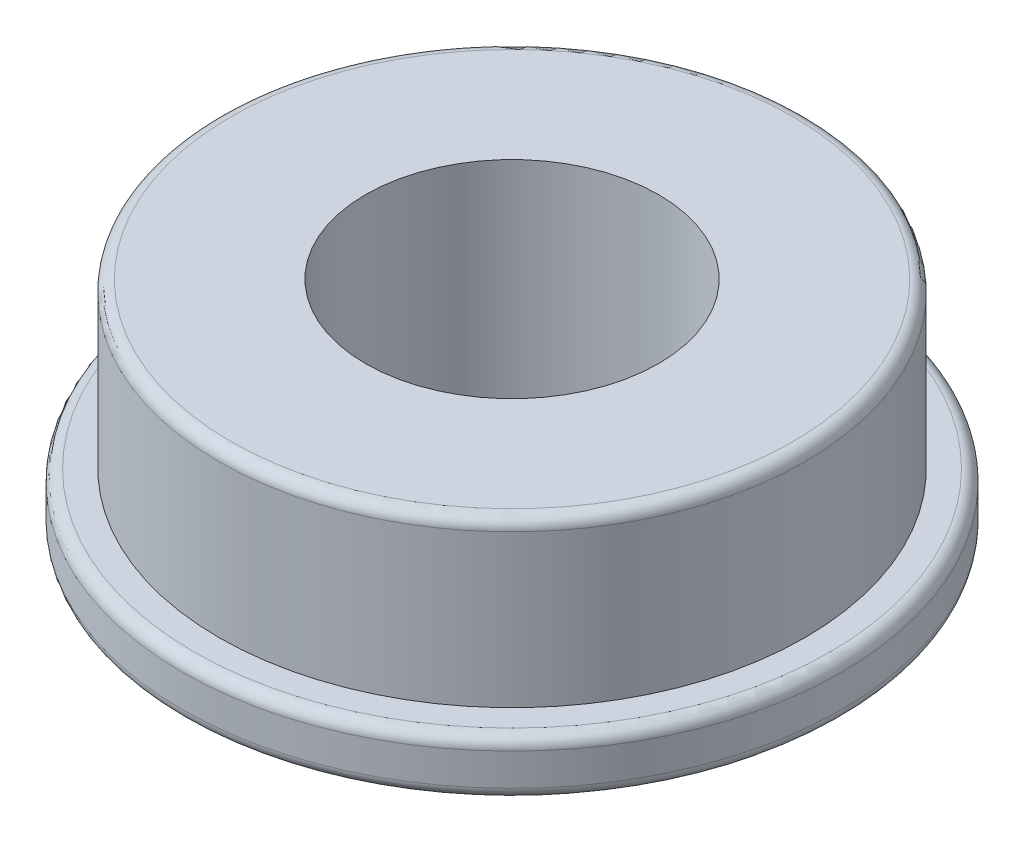
ISO-10303-21;
HEADER;
FILE_DESCRIPTION(('STEP AP214'),'2;1');
FILE_NAME('part.step','',(''),(''),'','','');
FILE_SCHEMA(('AUTOMOTIVE_DESIGN { 1 0 10303 214 1 1 1 1 }'));
ENDSEC;
DATA;
#1=APPLICATION_CONTEXT('core data for automotive mechanical design processes');
#2=APPLICATION_PROTOCOL_DEFINITION('international standard','automotive_design',2000,#1);
#3=PRODUCT_CONTEXT('',#1,'mechanical');
#4=PRODUCT('Part','Part','',(#3));
#5=PRODUCT_RELATED_PRODUCT_CATEGORY('part','',(#4));
#6=PRODUCT_DEFINITION_FORMATION('','',#4);
#7=PRODUCT_DEFINITION_CONTEXT('part definition',#1,'design');
#8=PRODUCT_DEFINITION('design','',#6,#7);
#9=PRODUCT_DEFINITION_SHAPE('','',#8);
#10=(LENGTH_UNIT() NAMED_UNIT(*) SI_UNIT(.MILLI.,.METRE.));
#11=(NAMED_UNIT(*) PLANE_ANGLE_UNIT() SI_UNIT($,.RADIAN.));
#12=(NAMED_UNIT(*) SI_UNIT($,.STERADIAN.) SOLID_ANGLE_UNIT());
#13=UNCERTAINTY_MEASURE_WITH_UNIT(LENGTH_MEASURE(1.E-05),#10,'distance_accuracy_value','');
#14=(GEOMETRIC_REPRESENTATION_CONTEXT(3) GLOBAL_UNCERTAINTY_ASSIGNED_CONTEXT((#13)) GLOBAL_UNIT_ASSIGNED_CONTEXT((#10,
#11,#12)) REPRESENTATION_CONTEXT('',''));
#15=CARTESIAN_POINT('',(0.,0.,0.));
#16=DIRECTION('',(0.,0.,1.));
#17=DIRECTION('',(1.,0.,0.));
#18=AXIS2_PLACEMENT_3D('',#15,#16,#17);
#19=CARTESIAN_POINT('',(0.,4.7625,0.));
#20=DIRECTION('',(0.,-1.,0.));
#21=DIRECTION('',(0.,0.,-1.));
#22=AXIS2_PLACEMENT_3D('',#19,#20,#21);
#23=CYLINDRICAL_SURFACE('',#22,3.175);
#24=CARTESIAN_POINT('',(0.,4.7625,0.));
#25=DIRECTION('',(0.,1.,0.));
#26=DIRECTION('',(0.,0.,1.));
#27=AXIS2_PLACEMENT_3D('',#24,#25,#26);
#28=CIRCLE('',#27,3.175);
#29=CARTESIAN_POINT('',(0.,4.7625,3.175));
#30=VERTEX_POINT('',#29);
#31=EDGE_CURVE('E75',#30,#30,#28,.T.);
#32=ORIENTED_EDGE('',*,*,#31,.T.);
#33=EDGE_LOOP('',(#32));
#34=FACE_BOUND('',#33,.T.);
#35=CARTESIAN_POINT('',(0.,0.,0.));
#36=DIRECTION('',(0.,1.,0.));
#37=DIRECTION('',(0.,0.,1.));
#38=AXIS2_PLACEMENT_3D('',#35,#36,#37);
#39=CIRCLE('',#38,3.175);
#40=CARTESIAN_POINT('',(0.,0.,3.175));
#41=VERTEX_POINT('',#40);
#42=EDGE_CURVE('E76',#41,#41,#39,.T.);
#43=ORIENTED_EDGE('',*,*,#42,.F.);
#44=EDGE_LOOP('',(#43));
#45=FACE_BOUND('',#44,.T.);
#46=ADVANCED_FACE('F43',(#34,#45),#23,.F.);
#47=CARTESIAN_POINT('',(0.,4.7625,0.));
#48=DIRECTION('',(0.,-1.,0.));
#49=DIRECTION('',(0.,0.,-1.));
#50=AXIS2_PLACEMENT_3D('',#47,#48,#49);
#51=CYLINDRICAL_SURFACE('',#50,6.35);
#52=CARTESIAN_POINT('',(0.,4.5085,0.));
#53=DIRECTION('',(0.,1.,0.));
#54=DIRECTION('',(0.,0.,1.));
#55=AXIS2_PLACEMENT_3D('',#52,#53,#54);
#56=CIRCLE('',#55,6.35);
#57=CARTESIAN_POINT('',(0.,4.5085,6.35));
#58=VERTEX_POINT('',#57);
#59=EDGE_CURVE('E10',#58,#58,#56,.F.);
#60=ORIENTED_EDGE('',*,*,#59,.T.);
#61=EDGE_LOOP('',(#60));
#62=FACE_BOUND('',#61,.T.);
#63=CARTESIAN_POINT('',(0.,1.2065,0.));
#64=DIRECTION('',(0.,1.,0.));
#65=DIRECTION('',(0.,0.,1.));
#66=AXIS2_PLACEMENT_3D('',#63,#64,#65);
#67=CIRCLE('',#66,6.35);
#68=CARTESIAN_POINT('',(0.,1.2065,6.35));
#69=VERTEX_POINT('',#68);
#70=EDGE_CURVE('E80',#69,#69,#67,.T.);
#71=ORIENTED_EDGE('',*,*,#70,.T.);
#72=EDGE_LOOP('',(#71));
#73=FACE_BOUND('',#72,.T.);
#74=ADVANCED_FACE('F88',(#62,#73),#51,.T.);
#75=CARTESIAN_POINT('',(0.,4.7625,0.));
#76=DIRECTION('',(0.,1.,0.));
#77=DIRECTION('',(0.,0.,1.));
#78=AXIS2_PLACEMENT_3D('',#75,#76,#77);
#79=PLANE('',#78);
#80=CARTESIAN_POINT('',(0.,4.7625,0.));
#81=DIRECTION('',(0.,1.,0.));
#82=DIRECTION('',(0.,0.,1.));
#83=AXIS2_PLACEMENT_3D('',#80,#81,#82);
#84=CIRCLE('',#83,6.096);
#85=CARTESIAN_POINT('',(0.,4.7625,6.096));
#86=VERTEX_POINT('',#85);
#87=EDGE_CURVE('E51',#86,#86,#84,.T.);
#88=ORIENTED_EDGE('',*,*,#87,.T.);
#89=EDGE_LOOP('',(#88));
#90=FACE_BOUND('',#89,.T.);
#91=ORIENTED_EDGE('',*,*,#31,.F.);
#92=EDGE_LOOP('',(#91));
#93=FACE_BOUND('',#92,.T.);
#94=ADVANCED_FACE('F112',(#90,#93),#79,.T.);
#95=CARTESIAN_POINT('',(0.,0.,0.));
#96=DIRECTION('',(0.,1.,0.));
#97=DIRECTION('',(0.,0.,1.));
#98=AXIS2_PLACEMENT_3D('',#95,#96,#97);
#99=PLANE('',#98);
#100=CARTESIAN_POINT('',(0.,0.,0.));
#101=DIRECTION('',(0.,1.,0.));
#102=DIRECTION('',(0.,0.,1.));
#103=AXIS2_PLACEMENT_3D('',#100,#101,#102);
#104=CIRCLE('',#103,6.88975);
#105=CARTESIAN_POINT('',(0.,0.,6.88975));
#106=VERTEX_POINT('',#105);
#107=EDGE_CURVE('E61',#106,#106,#104,.F.);
#108=ORIENTED_EDGE('',*,*,#107,.T.);
#109=EDGE_LOOP('',(#108));
#110=FACE_BOUND('',#109,.T.);
#111=ORIENTED_EDGE('',*,*,#42,.T.);
#112=EDGE_LOOP('',(#111));
#113=FACE_BOUND('',#112,.T.);
#114=ADVANCED_FACE('F103',(#110,#113),#99,.F.);
#115=CARTESIAN_POINT('',(0.,1.2065,0.));
#116=DIRECTION('',(0.,-1.,0.));
#117=DIRECTION('',(0.,0.,-1.));
#118=AXIS2_PLACEMENT_3D('',#115,#116,#117);
#119=CYLINDRICAL_SURFACE('',#118,7.14375);
#120=CARTESIAN_POINT('',(0.,0.254,0.));
#121=DIRECTION('',(0.,1.,0.));
#122=DIRECTION('',(0.,0.,1.));
#123=AXIS2_PLACEMENT_3D('',#120,#121,#122);
#124=CIRCLE('',#123,7.14375);
#125=CARTESIAN_POINT('',(0.,0.254,7.14375));
#126=VERTEX_POINT('',#125);
#127=EDGE_CURVE('E67',#126,#126,#124,.T.);
#128=ORIENTED_EDGE('',*,*,#127,.T.);
#129=EDGE_LOOP('',(#128));
#130=FACE_BOUND('',#129,.T.);
#131=CARTESIAN_POINT('',(0.,0.9525,0.));
#132=DIRECTION('',(0.,1.,0.));
#133=DIRECTION('',(0.,0.,1.));
#134=AXIS2_PLACEMENT_3D('',#131,#132,#133);
#135=CIRCLE('',#134,7.14375);
#136=CARTESIAN_POINT('',(0.,0.9525,7.14375));
#137=VERTEX_POINT('',#136);
#138=EDGE_CURVE('E71',#137,#137,#135,.F.);
#139=ORIENTED_EDGE('',*,*,#138,.T.);
#140=EDGE_LOOP('',(#139));
#141=FACE_BOUND('',#140,.T.);
#142=ADVANCED_FACE('F93',(#130,#141),#119,.T.);
#143=CARTESIAN_POINT('',(0.,1.2065,0.));
#144=DIRECTION('',(0.,1.,0.));
#145=DIRECTION('',(0.,0.,1.));
#146=AXIS2_PLACEMENT_3D('',#143,#144,#145);
#147=PLANE('',#146);
#148=CARTESIAN_POINT('',(0.,1.2065,0.));
#149=DIRECTION('',(0.,1.,0.));
#150=DIRECTION('',(0.,0.,1.));
#151=AXIS2_PLACEMENT_3D('',#148,#149,#150);
#152=CIRCLE('',#151,6.88975);
#153=CARTESIAN_POINT('',(0.,1.2065,6.88975));
#154=VERTEX_POINT('',#153);
#155=EDGE_CURVE('E56',#154,#154,#152,.T.);
#156=ORIENTED_EDGE('',*,*,#155,.T.);
#157=EDGE_LOOP('',(#156));
#158=FACE_BOUND('',#157,.T.);
#159=ORIENTED_EDGE('',*,*,#70,.F.);
#160=EDGE_LOOP('',(#159));
#161=FACE_BOUND('',#160,.T.);
#162=ADVANCED_FACE('F90',(#158,#161),#147,.T.);
#163=CARTESIAN_POINT('',(0.,0.254,0.));
#164=DIRECTION('',(0.,1.,0.));
#165=DIRECTION('',(0.,0.,1.));
#166=AXIS2_PLACEMENT_3D('',#163,#164,#165);
#167=TOROIDAL_SURFACE('',#166,6.88975,0.254);
#168=ORIENTED_EDGE('',*,*,#107,.F.);
#169=EDGE_LOOP('',(#168));
#170=FACE_BOUND('',#169,.T.);
#171=ORIENTED_EDGE('',*,*,#127,.F.);
#172=EDGE_LOOP('',(#171));
#173=FACE_BOUND('',#172,.T.);
#174=ADVANCED_FACE('F92',(#170,#173),#167,.T.);
#175=CARTESIAN_POINT('',(0.,0.9525,0.));
#176=DIRECTION('',(0.,1.,0.));
#177=DIRECTION('',(0.,0.,1.));
#178=AXIS2_PLACEMENT_3D('',#175,#176,#177);
#179=TOROIDAL_SURFACE('',#178,6.88975,0.254);
#180=ORIENTED_EDGE('',*,*,#138,.F.);
#181=EDGE_LOOP('',(#180));
#182=FACE_BOUND('',#181,.T.);
#183=ORIENTED_EDGE('',*,*,#155,.F.);
#184=EDGE_LOOP('',(#183));
#185=FACE_BOUND('',#184,.T.);
#186=ADVANCED_FACE('F100',(#182,#185),#179,.T.);
#187=CARTESIAN_POINT('',(0.,4.5085,0.));
#188=DIRECTION('',(0.,1.,0.));
#189=DIRECTION('',(0.,0.,1.));
#190=AXIS2_PLACEMENT_3D('',#187,#188,#189);
#191=TOROIDAL_SURFACE('',#190,6.096,0.254);
#192=ORIENTED_EDGE('',*,*,#59,.F.);
#193=EDGE_LOOP('',(#192));
#194=FACE_BOUND('',#193,.T.);
#195=ORIENTED_EDGE('',*,*,#87,.F.);
#196=EDGE_LOOP('',(#195));
#197=FACE_BOUND('',#196,.T.);
#198=ADVANCED_FACE('F45',(#194,#197),#191,.T.);
#199=CLOSED_SHELL('',(#46,#74,#94,#114,#142,#162,#174,#186,#198));
#200=MANIFOLD_SOLID_BREP('B2',#199);
#201=ADVANCED_BREP_SHAPE_REPRESENTATION('',(#18,#200),#14);
#202=SHAPE_DEFINITION_REPRESENTATION(#9,#201);
ENDSEC;
END-ISO-10303-21;
